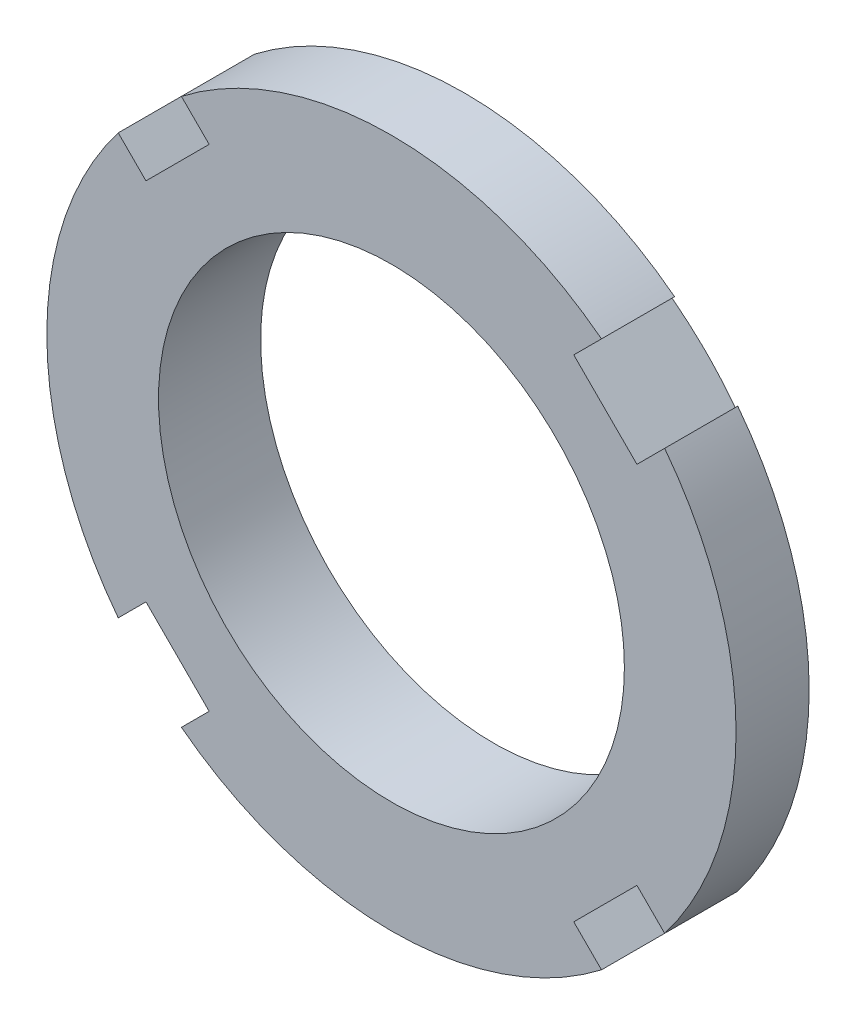
ISO-10303-21;
HEADER;
FILE_DESCRIPTION(('STEP AP214'),'2;1');
FILE_NAME('part.step','',(''),(''),'','','');
FILE_SCHEMA(('AUTOMOTIVE_DESIGN { 1 0 10303 214 1 1 1 1 }'));
ENDSEC;
DATA;
#1=APPLICATION_CONTEXT('core data for automotive mechanical design processes');
#2=APPLICATION_PROTOCOL_DEFINITION('international standard','automotive_design',2000,#1);
#3=PRODUCT_CONTEXT('',#1,'mechanical');
#4=PRODUCT('Part','Part','',(#3));
#5=PRODUCT_RELATED_PRODUCT_CATEGORY('part','',(#4));
#6=PRODUCT_DEFINITION_FORMATION('','',#4);
#7=PRODUCT_DEFINITION_CONTEXT('part definition',#1,'design');
#8=PRODUCT_DEFINITION('design','',#6,#7);
#9=PRODUCT_DEFINITION_SHAPE('','',#8);
#10=(LENGTH_UNIT() NAMED_UNIT(*) SI_UNIT(.MILLI.,.METRE.));
#11=(NAMED_UNIT(*) PLANE_ANGLE_UNIT() SI_UNIT($,.RADIAN.));
#12=(NAMED_UNIT(*) SI_UNIT($,.STERADIAN.) SOLID_ANGLE_UNIT());
#13=UNCERTAINTY_MEASURE_WITH_UNIT(LENGTH_MEASURE(1.E-05),#10,'distance_accuracy_value','');
#14=(GEOMETRIC_REPRESENTATION_CONTEXT(3) GLOBAL_UNCERTAINTY_ASSIGNED_CONTEXT((#13)) GLOBAL_UNIT_ASSIGNED_CONTEXT((#10,
#11,#12)) REPRESENTATION_CONTEXT('',''));
#15=CARTESIAN_POINT('',(0.,0.,0.));
#16=DIRECTION('',(0.,0.,1.));
#17=DIRECTION('',(1.,0.,0.));
#18=AXIS2_PLACEMENT_3D('',#15,#16,#17);
#19=CARTESIAN_POINT('',(0.,0.,8.));
#20=DIRECTION('',(0.,0.,-1.));
#21=DIRECTION('',(-1.,0.,0.));
#22=AXIS2_PLACEMENT_3D('',#19,#20,#21);
#23=CYLINDRICAL_SURFACE('',#22,27.);
#24=DIRECTION('',(0.,0.,1.));
#25=VECTOR('',#24,1.);
#26=CARTESIAN_POINT('',(-21.4056687517953,16.4559212834898,0.));
#27=LINE('',#26,#25);
#28=CARTESIAN_POINT('',(-21.4056687517953,16.4559212834898,2.27292657619126));
#29=VERTEX_POINT('',#28);
#30=CARTESIAN_POINT('',(-21.4056687517953,16.4559212834898,8.));
#31=VERTEX_POINT('',#30);
#32=EDGE_CURVE('E255',#29,#31,#27,.T.);
#33=ORIENTED_EDGE('',*,*,#32,.F.);
#34=CARTESIAN_POINT('',(0.,0.,2.27292657619126));
#35=DIRECTION('',(0.,0.,1.));
#36=DIRECTION('',(1.,0.,0.));
#37=AXIS2_PLACEMENT_3D('',#34,#35,#36);
#38=CIRCLE('',#37,27.);
#39=CARTESIAN_POINT('',(-21.4056687517956,-16.4559212834895,2.27292657619126));
#40=VERTEX_POINT('',#39);
#41=EDGE_CURVE('E250',#29,#40,#38,.T.);
#42=ORIENTED_EDGE('',*,*,#41,.T.);
#43=DIRECTION('',(0.,0.,1.));
#44=VECTOR('',#43,1.);
#45=CARTESIAN_POINT('',(-21.4056687517956,-16.4559212834895,0.));
#46=LINE('',#45,#44);
#47=CARTESIAN_POINT('',(-21.4056687517955,-16.4559212834895,8.));
#48=VERTEX_POINT('',#47);
#49=EDGE_CURVE('E275',#40,#48,#46,.T.);
#50=ORIENTED_EDGE('',*,*,#49,.T.);
#51=CARTESIAN_POINT('',(0.,0.,8.));
#52=DIRECTION('',(0.,0.,1.));
#53=DIRECTION('',(1.,0.,0.));
#54=AXIS2_PLACEMENT_3D('',#51,#52,#53);
#55=CIRCLE('',#54,27.);
#56=EDGE_CURVE('E192',#31,#48,#55,.T.);
#57=ORIENTED_EDGE('',*,*,#56,.F.);
#58=EDGE_LOOP('',(#33,#42,#50,#57));
#59=FACE_BOUND('',#58,.T.);
#60=ADVANCED_FACE('F33',(#59),#23,.T.);
#61=DIRECTION('',(0.,0.,1.));
#62=VECTOR('',#61,1.);
#63=CARTESIAN_POINT('',(-16.4559212834897,-21.4056687517954,0.));
#64=LINE('',#63,#62);
#65=CARTESIAN_POINT('',(-16.4559212834897,-21.4056687517954,2.27292657619126));
#66=VERTEX_POINT('',#65);
#67=CARTESIAN_POINT('',(-16.4559212834897,-21.4056687517954,8.));
#68=VERTEX_POINT('',#67);
#69=EDGE_CURVE('E273',#66,#68,#64,.T.);
#70=ORIENTED_EDGE('',*,*,#69,.F.);
#71=CARTESIAN_POINT('',(16.4559212834896,-21.4056687517955,2.27292657619126));
#72=VERTEX_POINT('',#71);
#73=EDGE_CURVE('E169',#66,#72,#38,.T.);
#74=ORIENTED_EDGE('',*,*,#73,.T.);
#75=DIRECTION('',(0.,0.,1.));
#76=VECTOR('',#75,1.);
#77=CARTESIAN_POINT('',(16.4559212834896,-21.4056687517955,0.));
#78=LINE('',#77,#76);
#79=CARTESIAN_POINT('',(16.4559212834896,-21.4056687517955,8.));
#80=VERTEX_POINT('',#79);
#81=EDGE_CURVE('E218',#72,#80,#78,.T.);
#82=ORIENTED_EDGE('',*,*,#81,.T.);
#83=EDGE_CURVE('E197',#68,#80,#55,.T.);
#84=ORIENTED_EDGE('',*,*,#83,.F.);
#85=EDGE_LOOP('',(#70,#74,#82,#84));
#86=FACE_BOUND('',#85,.T.);
#87=ADVANCED_FACE('F394',(#86),#23,.T.);
#88=DIRECTION('',(0.,0.,1.));
#89=VECTOR('',#88,1.);
#90=CARTESIAN_POINT('',(21.4056687517954,-16.4559212834897,0.));
#91=LINE('',#90,#89);
#92=CARTESIAN_POINT('',(21.4056687517954,-16.4559212834897,2.27292657619126));
#93=VERTEX_POINT('',#92);
#94=CARTESIAN_POINT('',(21.4056687517954,-16.4559212834897,8.));
#95=VERTEX_POINT('',#94);
#96=EDGE_CURVE('E168',#93,#95,#91,.T.);
#97=ORIENTED_EDGE('',*,*,#96,.F.);
#98=CARTESIAN_POINT('',(21.4056687517954,16.4559212834897,2.27292657619126));
#99=VERTEX_POINT('',#98);
#100=EDGE_CURVE('E153',#93,#99,#38,.T.);
#101=ORIENTED_EDGE('',*,*,#100,.T.);
#102=DIRECTION('',(0.,0.,1.));
#103=VECTOR('',#102,1.);
#104=CARTESIAN_POINT('',(21.4056687517954,16.4559212834897,0.));
#105=LINE('',#104,#103);
#106=CARTESIAN_POINT('',(21.4056687517954,16.4559212834897,8.));
#107=VERTEX_POINT('',#106);
#108=EDGE_CURVE('E166',#99,#107,#105,.T.);
#109=ORIENTED_EDGE('',*,*,#108,.T.);
#110=EDGE_CURVE('E188',#95,#107,#55,.T.);
#111=ORIENTED_EDGE('',*,*,#110,.F.);
#112=EDGE_LOOP('',(#97,#101,#109,#111));
#113=FACE_BOUND('',#112,.T.);
#114=ADVANCED_FACE('F164',(#113),#23,.T.);
#115=CARTESIAN_POINT('',(0.,0.,8.));
#116=DIRECTION('',(0.,0.,1.));
#117=DIRECTION('',(1.,0.,0.));
#118=AXIS2_PLACEMENT_3D('',#115,#116,#117);
#119=PLANE('',#118);
#120=DIRECTION('',(0.70710678118654,-0.707106781186555,0.));
#121=VECTOR('',#120,1.);
#122=CARTESIAN_POINT('',(-21.4056687517953,16.4559212834898,8.));
#123=LINE('',#122,#121);
#124=CARTESIAN_POINT('',(-19.233304448274,14.2835569799684,8.));
#125=VERTEX_POINT('',#124);
#126=EDGE_CURVE('E260',#31,#125,#123,.T.);
#127=ORIENTED_EDGE('',*,*,#126,.F.);
#128=ORIENTED_EDGE('',*,*,#56,.T.);
#129=DIRECTION('',(-0.70710678118655,-0.707106781186545,0.));
#130=VECTOR('',#129,1.);
#131=CARTESIAN_POINT('',(-21.4056687517955,-16.4559212834895,8.));
#132=LINE('',#131,#130);
#133=CARTESIAN_POINT('',(-19.2333044482742,-14.2835569799682,8.));
#134=VERTEX_POINT('',#133);
#135=EDGE_CURVE('E267',#134,#48,#132,.T.);
#136=ORIENTED_EDGE('',*,*,#135,.F.);
#137=DIRECTION('',(-0.707106781186544,0.707106781186551,0.));
#138=VECTOR('',#137,1.);
#139=CARTESIAN_POINT('',(-14.2835569799684,-19.233304448274,8.));
#140=LINE('',#139,#138);
#141=CARTESIAN_POINT('',(-14.2835569799684,-19.233304448274,8.));
#142=VERTEX_POINT('',#141);
#143=EDGE_CURVE('E264',#142,#134,#140,.T.);
#144=ORIENTED_EDGE('',*,*,#143,.F.);
#145=DIRECTION('',(0.707106781186552,0.707106781186543,0.));
#146=VECTOR('',#145,1.);
#147=CARTESIAN_POINT('',(-16.4559212834897,-21.4056687517954,8.));
#148=LINE('',#147,#146);
#149=EDGE_CURVE('E211',#68,#142,#148,.T.);
#150=ORIENTED_EDGE('',*,*,#149,.F.);
#151=ORIENTED_EDGE('',*,*,#83,.T.);
#152=DIRECTION('',(0.707106781186548,-0.707106781186547,0.));
#153=VECTOR('',#152,1.);
#154=CARTESIAN_POINT('',(16.4559212834896,-21.4056687517955,8.));
#155=LINE('',#154,#153);
#156=CARTESIAN_POINT('',(14.2835569799682,-19.2333044482741,8.));
#157=VERTEX_POINT('',#156);
#158=EDGE_CURVE('E208',#157,#80,#155,.T.);
#159=ORIENTED_EDGE('',*,*,#158,.F.);
#160=DIRECTION('',(-0.707106781186548,-0.707106781186547,0.));
#161=VECTOR('',#160,1.);
#162=CARTESIAN_POINT('',(19.2333044482741,-14.2835569799683,8.));
#163=LINE('',#162,#161);
#164=CARTESIAN_POINT('',(19.2333044482741,-14.2835569799683,8.));
#165=VERTEX_POINT('',#164);
#166=EDGE_CURVE('E223',#165,#157,#163,.T.);
#167=ORIENTED_EDGE('',*,*,#166,.F.);
#168=DIRECTION('',(-0.707106781186545,0.70710678118655,0.));
#169=VECTOR('',#168,1.);
#170=CARTESIAN_POINT('',(21.4056687517954,-16.4559212834897,8.));
#171=LINE('',#170,#169);
#172=EDGE_CURVE('E222',#95,#165,#171,.T.);
#173=ORIENTED_EDGE('',*,*,#172,.F.);
#174=ORIENTED_EDGE('',*,*,#110,.T.);
#175=DIRECTION('',(0.707106781186545,0.70710678118655,0.));
#176=VECTOR('',#175,1.);
#177=CARTESIAN_POINT('',(21.4056687517954,16.4559212834897,8.));
#178=LINE('',#177,#176);
#179=CARTESIAN_POINT('',(19.2333044482741,14.2835569799683,8.));
#180=VERTEX_POINT('',#179);
#181=EDGE_CURVE('E175',#180,#107,#178,.T.);
#182=ORIENTED_EDGE('',*,*,#181,.F.);
#183=DIRECTION('',(0.707106781186549,-0.707106781186546,0.));
#184=VECTOR('',#183,1.);
#185=CARTESIAN_POINT('',(14.2835569799682,19.2333044482741,8.));
#186=LINE('',#185,#184);
#187=CARTESIAN_POINT('',(14.2835569799682,19.2333044482741,8.));
#188=VERTEX_POINT('',#187);
#189=EDGE_CURVE('E233',#188,#180,#186,.T.);
#190=ORIENTED_EDGE('',*,*,#189,.F.);
#191=DIRECTION('',(-0.707106781186547,-0.707106781186548,0.));
#192=VECTOR('',#191,1.);
#193=CARTESIAN_POINT('',(16.4559212834896,21.4056687517955,8.));
#194=LINE('',#193,#192);
#195=CARTESIAN_POINT('',(16.4559212834896,21.4056687517955,8.));
#196=VERTEX_POINT('',#195);
#197=EDGE_CURVE('E181',#196,#188,#194,.T.);
#198=ORIENTED_EDGE('',*,*,#197,.F.);
#199=CARTESIAN_POINT('',(-16.4559212834894,21.4056687517956,8.));
#200=VERTEX_POINT('',#199);
#201=EDGE_CURVE('E46',#196,#200,#55,.T.);
#202=ORIENTED_EDGE('',*,*,#201,.T.);
#203=DIRECTION('',(-0.707106781186543,0.707106781186552,0.));
#204=VECTOR('',#203,1.);
#205=CARTESIAN_POINT('',(-16.4559212834894,21.4056687517956,8.));
#206=LINE('',#205,#204);
#207=CARTESIAN_POINT('',(-14.2835569799681,19.2333044482742,8.));
#208=VERTEX_POINT('',#207);
#209=EDGE_CURVE('E254',#208,#200,#206,.T.);
#210=ORIENTED_EDGE('',*,*,#209,.F.);
#211=DIRECTION('',(0.707106781186553,0.707106781186542,0.));
#212=VECTOR('',#211,1.);
#213=CARTESIAN_POINT('',(-19.233304448274,14.2835569799684,8.));
#214=LINE('',#213,#212);
#215=EDGE_CURVE('E408',#125,#208,#214,.T.);
#216=ORIENTED_EDGE('',*,*,#215,.F.);
#217=EDGE_LOOP('',(#127,#128,#136,#144,#150,#151,#159,#167,#173,#174,#182,#190,#198,#202,#210,#216));
#218=FACE_BOUND('',#217,.T.);
#219=CARTESIAN_POINT('',(0.,0.,8.));
#220=DIRECTION('',(0.,0.,1.));
#221=DIRECTION('',(1.,0.,0.));
#222=AXIS2_PLACEMENT_3D('',#219,#220,#221);
#223=CIRCLE('',#222,18.25);
#224=CARTESIAN_POINT('',(18.25,0.,8.));
#225=VERTEX_POINT('',#224);
#226=EDGE_CURVE('E185',#225,#225,#223,.T.);
#227=ORIENTED_EDGE('',*,*,#226,.F.);
#228=EDGE_LOOP('',(#227));
#229=FACE_BOUND('',#228,.T.);
#230=ADVANCED_FACE('F205',(#218,#229),#119,.T.);
#231=CARTESIAN_POINT('',(0.,0.,0.));
#232=DIRECTION('',(0.,0.,1.));
#233=DIRECTION('',(1.,0.,0.));
#234=AXIS2_PLACEMENT_3D('',#231,#232,#233);
#235=PLANE('',#234);
#236=CARTESIAN_POINT('',(0.,0.,0.));
#237=DIRECTION('',(0.,0.,1.));
#238=DIRECTION('',(1.,0.,0.));
#239=AXIS2_PLACEMENT_3D('',#236,#237,#238);
#240=CIRCLE('',#239,23.5);
#241=CARTESIAN_POINT('',(23.5,0.,0.));
#242=VERTEX_POINT('',#241);
#243=EDGE_CURVE('E249',#242,#242,#240,.T.);
#244=ORIENTED_EDGE('',*,*,#243,.F.);
#245=EDGE_LOOP('',(#244));
#246=FACE_BOUND('',#245,.T.);
#247=CARTESIAN_POINT('',(0.,0.,0.));
#248=DIRECTION('',(0.,0.,1.));
#249=DIRECTION('',(1.,0.,0.));
#250=AXIS2_PLACEMENT_3D('',#247,#248,#249);
#251=CIRCLE('',#250,18.25);
#252=CARTESIAN_POINT('',(18.25,0.,0.));
#253=VERTEX_POINT('',#252);
#254=EDGE_CURVE('E189',#253,#253,#251,.T.);
#255=ORIENTED_EDGE('',*,*,#254,.T.);
#256=EDGE_LOOP('',(#255));
#257=FACE_BOUND('',#256,.T.);
#258=ADVANCED_FACE('F385',(#246,#257),#235,.F.);
#259=DIRECTION('',(0.,0.,1.));
#260=VECTOR('',#259,1.);
#261=CARTESIAN_POINT('',(16.4559212834896,21.4056687517955,0.));
#262=LINE('',#261,#260);
#263=CARTESIAN_POINT('',(16.4559212834896,21.4056687517955,2.27292657619126));
#264=VERTEX_POINT('',#263);
#265=EDGE_CURVE('E176',#264,#196,#262,.T.);
#266=ORIENTED_EDGE('',*,*,#265,.F.);
#267=CARTESIAN_POINT('',(-16.4559212834894,21.4056687517956,2.27292657619126));
#268=VERTEX_POINT('',#267);
#269=EDGE_CURVE('E171',#264,#268,#38,.T.);
#270=ORIENTED_EDGE('',*,*,#269,.T.);
#271=DIRECTION('',(0.,0.,1.));
#272=VECTOR('',#271,1.);
#273=CARTESIAN_POINT('',(-16.4559212834894,21.4056687517956,0.));
#274=LINE('',#273,#272);
#275=EDGE_CURVE('E60',#268,#200,#274,.T.);
#276=ORIENTED_EDGE('',*,*,#275,.T.);
#277=ORIENTED_EDGE('',*,*,#201,.F.);
#278=EDGE_LOOP('',(#266,#270,#276,#277));
#279=FACE_BOUND('',#278,.T.);
#280=ADVANCED_FACE('F35',(#279),#23,.T.);
#281=CARTESIAN_POINT('',(0.,0.,8.));
#282=DIRECTION('',(0.,0.,-1.));
#283=DIRECTION('',(-1.,0.,0.));
#284=AXIS2_PLACEMENT_3D('',#281,#282,#283);
#285=CYLINDRICAL_SURFACE('',#284,18.25);
#286=ORIENTED_EDGE('',*,*,#226,.T.);
#287=EDGE_LOOP('',(#286));
#288=FACE_BOUND('',#287,.T.);
#289=ORIENTED_EDGE('',*,*,#254,.F.);
#290=EDGE_LOOP('',(#289));
#291=FACE_BOUND('',#290,.T.);
#292=ADVANCED_FACE('F379',(#288,#291),#285,.F.);
#293=CARTESIAN_POINT('',(14.2835569799682,19.2333044482741,0.));
#294=DIRECTION('',(-0.707106781186546,-0.707106781186549,0.));
#295=DIRECTION('',(0.707106781186549,-0.707106781186546,0.));
#296=AXIS2_PLACEMENT_3D('',#293,#294,#295);
#297=PLANE('',#296);
#298=DIRECTION('',(0.,0.,1.));
#299=VECTOR('',#298,1.);
#300=CARTESIAN_POINT('',(19.2333044482741,14.2835569799683,0.));
#301=LINE('',#300,#299);
#302=CARTESIAN_POINT('',(19.2333044482741,14.2835569799683,0.296808423875628));
#303=VERTEX_POINT('',#302);
#304=EDGE_CURVE('E177',#303,#180,#301,.T.);
#305=ORIENTED_EDGE('',*,*,#304,.F.);
#306=CARTESIAN_POINT('',(19.2335044482741,14.2833569799683,0.296835259662044));
#307=CARTESIAN_POINT('',(19.0276255765084,14.4892358517339,0.269204998764408));
#308=CARTESIAN_POINT('',(18.8215271464313,14.6953342818111,0.244928484965329));
#309=CARTESIAN_POINT('',(18.4089816121952,15.1078798160472,0.203205328642449));
#310=CARTESIAN_POINT('',(18.2025345020211,15.3143269262213,0.185758805179095));
#311=CARTESIAN_POINT('',(17.5837846466935,15.9330767815489,0.143914531250112));
#312=CARTESIAN_POINT('',(17.1711076804073,16.345753747835,0.129881518639503));
#313=CARTESIAN_POINT('',(16.345753747835,17.1711076804074,0.129881518639504));
#314=CARTESIAN_POINT('',(15.9330767815488,17.5837846466936,0.143914531250114));
#315=CARTESIAN_POINT('',(15.3143269262212,18.2025345020212,0.185758805179094));
#316=CARTESIAN_POINT('',(15.1078798160471,18.4089816121952,0.203205328642446));
#317=CARTESIAN_POINT('',(14.695334281811,18.8215271464313,0.244928484965325));
#318=CARTESIAN_POINT('',(14.4892358517339,19.0276255765085,0.269204998764403));
#319=CARTESIAN_POINT('',(14.2833569799682,19.2335044482741,0.296835259662042));
#320=B_SPLINE_CURVE_WITH_KNOTS('',3,(#306,#307,#308,#309,#310,#311,#312,#313,#314,#315,#316,
#317,#318,#319),.UNSPECIFIED.,.F.,.F.,(4,2,2,2,2,2,4),(0.,0.877357997829844,1.75473128909054,
3.50536630015111,5.25600131121167,6.13337460247237,7.01073260030221),.UNSPECIFIED.);
#321=CARTESIAN_POINT('',(14.2835569799682,19.2333044482741,0.296808423875627));
#322=VERTEX_POINT('',#321);
#323=EDGE_CURVE('E156',#303,#322,#320,.T.);
#324=ORIENTED_EDGE('',*,*,#323,.T.);
#325=DIRECTION('',(0.,0.,1.));
#326=VECTOR('',#325,1.);
#327=CARTESIAN_POINT('',(14.2835569799682,19.2333044482741,0.));
#328=LINE('',#327,#326);
#329=EDGE_CURVE('E179',#322,#188,#328,.T.);
#330=ORIENTED_EDGE('',*,*,#329,.T.);
#331=ORIENTED_EDGE('',*,*,#189,.T.);
#332=EDGE_LOOP('',(#305,#324,#330,#331));
#333=FACE_BOUND('',#332,.T.);
#334=ADVANCED_FACE('F243',(#333),#297,.F.);
#335=CARTESIAN_POINT('',(16.4559212834896,21.4056687517955,0.));
#336=DIRECTION('',(-0.707106781186548,0.707106781186547,0.));
#337=DIRECTION('',(-0.707106781186547,-0.707106781186548,0.));
#338=AXIS2_PLACEMENT_3D('',#335,#336,#337);
#339=PLANE('',#338);
#340=ORIENTED_EDGE('',*,*,#329,.F.);
#341=CARTESIAN_POINT('',(14.2833569799682,19.2331044482741,0.296626714473345));
#342=CARTESIAN_POINT('',(14.6456065649505,19.5953540332564,0.625771711017591));
#343=CARTESIAN_POINT('',(15.0077950501456,19.9575425184515,0.955051042645041));
#344=CARTESIAN_POINT('',(15.732049817985,20.6817972862909,1.61387837335876));
#345=CARTESIAN_POINT('',(16.0941161006304,21.0438635689363,1.94342637244281));
#346=CARTESIAN_POINT('',(16.4561212834896,21.4058687517955,2.27310870660786));
#347=B_SPLINE_CURVE_WITH_KNOTS('',3,(#341,#342,#343,#344,#345,#346),.UNSPECIFIED.,.F.,.F.,(4,2,
4),(0.,1.82676568904602,3.65353136307705),.UNSPECIFIED.);
#348=EDGE_CURVE('E370',#322,#264,#347,.T.);
#349=ORIENTED_EDGE('',*,*,#348,.T.);
#350=ORIENTED_EDGE('',*,*,#265,.T.);
#351=ORIENTED_EDGE('',*,*,#197,.T.);
#352=EDGE_LOOP('',(#340,#349,#350,#351));
#353=FACE_BOUND('',#352,.T.);
#354=ADVANCED_FACE('F247',(#353),#339,.F.);
#355=CARTESIAN_POINT('',(21.4056687517954,16.4559212834897,0.));
#356=DIRECTION('',(0.70710678118655,-0.707106781186545,0.));
#357=DIRECTION('',(0.707106781186545,0.70710678118655,0.));
#358=AXIS2_PLACEMENT_3D('',#355,#356,#357);
#359=PLANE('',#358);
#360=ORIENTED_EDGE('',*,*,#108,.F.);
#361=CARTESIAN_POINT('',(21.4058687517954,16.4561212834897,2.27310870660787));
#362=CARTESIAN_POINT('',(21.0438635689362,16.0941161006304,1.94342637244281));
#363=CARTESIAN_POINT('',(20.6817972862909,15.7320498179851,1.61387837335876));
#364=CARTESIAN_POINT('',(19.9575425184514,15.0077950501456,0.955051042645044));
#365=CARTESIAN_POINT('',(19.5953540332563,14.6456065649505,0.625771711017594));
#366=CARTESIAN_POINT('',(19.2331044482741,14.2833569799683,0.29662671447335));
#367=B_SPLINE_CURVE_WITH_KNOTS('',3,(#361,#362,#363,#364,#365,#366),.UNSPECIFIED.,.F.,.F.,(4,2,
4),(0.,1.82676567403102,3.65353136307704),.UNSPECIFIED.);
#368=EDGE_CURVE('E150',#99,#303,#367,.T.);
#369=ORIENTED_EDGE('',*,*,#368,.T.);
#370=ORIENTED_EDGE('',*,*,#304,.T.);
#371=ORIENTED_EDGE('',*,*,#181,.T.);
#372=EDGE_LOOP('',(#360,#369,#370,#371));
#373=FACE_BOUND('',#372,.T.);
#374=ADVANCED_FACE('F173',(#373),#359,.F.);
#375=CARTESIAN_POINT('',(19.2333044482741,-14.2835569799683,0.));
#376=DIRECTION('',(-0.707106781186547,0.707106781186548,0.));
#377=DIRECTION('',(-0.707106781186548,-0.707106781186547,0.));
#378=AXIS2_PLACEMENT_3D('',#375,#376,#377);
#379=PLANE('',#378);
#380=DIRECTION('',(0.,0.,1.));
#381=VECTOR('',#380,1.);
#382=CARTESIAN_POINT('',(14.2835569799682,-19.2333044482741,0.));
#383=LINE('',#382,#381);
#384=CARTESIAN_POINT('',(14.2835569799682,-19.2333044482741,0.296808423875627));
#385=VERTEX_POINT('',#384);
#386=EDGE_CURVE('E220',#385,#157,#383,.T.);
#387=ORIENTED_EDGE('',*,*,#386,.F.);
#388=CARTESIAN_POINT('',(14.2833569799682,-19.2335044482741,0.296835259662046));
#389=CARTESIAN_POINT('',(14.4892358517339,-19.0276255765085,0.26920499876441));
#390=CARTESIAN_POINT('',(14.695334281811,-18.8215271464313,0.244928484965331));
#391=CARTESIAN_POINT('',(15.1078798160471,-18.4089816121953,0.20320532864245));
#392=CARTESIAN_POINT('',(15.3143269262212,-18.2025345020212,0.185758805179095));
#393=CARTESIAN_POINT('',(15.9330767815488,-17.5837846466936,0.143914531250111));
#394=CARTESIAN_POINT('',(16.345753747835,-17.1711076804074,0.129881518639502));
#395=CARTESIAN_POINT('',(17.1711076804073,-16.345753747835,0.129881518639503));
#396=CARTESIAN_POINT('',(17.5837846466935,-15.9330767815489,0.143914531250112));
#397=CARTESIAN_POINT('',(18.2025345020211,-15.3143269262213,0.185758805179094));
#398=CARTESIAN_POINT('',(18.4089816121952,-15.1078798160472,0.203205328642448));
#399=CARTESIAN_POINT('',(18.8215271464313,-14.6953342818111,0.244928484965328));
#400=CARTESIAN_POINT('',(19.0276255765084,-14.4892358517339,0.269204998764406));
#401=CARTESIAN_POINT('',(19.2335044482741,-14.2833569799683,0.296835259662043));
#402=B_SPLINE_CURVE_WITH_KNOTS('',3,(#388,#389,#390,#391,#392,#393,#394,#395,#396,#397,#398,
#399,#400,#401),.UNSPECIFIED.,.F.,.F.,(4,2,2,2,2,2,4),(0.,0.877357997829843,1.75473128909054,
3.50536630015111,5.25600131121167,6.13337460247237,7.01073260030222),.UNSPECIFIED.);
#403=CARTESIAN_POINT('',(19.2333044482741,-14.2835569799683,0.296808423875628));
#404=VERTEX_POINT('',#403);
#405=EDGE_CURVE('E350',#385,#404,#402,.T.);
#406=ORIENTED_EDGE('',*,*,#405,.T.);
#407=DIRECTION('',(0.,0.,1.));
#408=VECTOR('',#407,1.);
#409=CARTESIAN_POINT('',(19.2333044482741,-14.2835569799683,0.));
#410=LINE('',#409,#408);
#411=EDGE_CURVE('E231',#404,#165,#410,.T.);
#412=ORIENTED_EDGE('',*,*,#411,.T.);
#413=ORIENTED_EDGE('',*,*,#166,.T.);
#414=EDGE_LOOP('',(#387,#406,#412,#413));
#415=FACE_BOUND('',#414,.T.);
#416=ADVANCED_FACE('F426',(#415),#379,.F.);
#417=CARTESIAN_POINT('',(21.4056687517954,-16.4559212834897,0.));
#418=DIRECTION('',(0.70710678118655,0.707106781186545,0.));
#419=DIRECTION('',(-0.707106781186545,0.70710678118655,0.));
#420=AXIS2_PLACEMENT_3D('',#417,#418,#419);
#421=PLANE('',#420);
#422=ORIENTED_EDGE('',*,*,#411,.F.);
#423=CARTESIAN_POINT('',(19.2331044482741,-14.2833569799683,0.29662671447335));
#424=CARTESIAN_POINT('',(19.5953540332563,-14.6456065649505,0.625771711017594));
#425=CARTESIAN_POINT('',(19.9575425184514,-15.0077950501456,0.955051042645043));
#426=CARTESIAN_POINT('',(20.6817972862909,-15.7320498179851,1.61387837335876));
#427=CARTESIAN_POINT('',(21.0438635689362,-16.0941161006304,1.94342637244281));
#428=CARTESIAN_POINT('',(21.4058687517954,-16.4561212834897,2.27310870660786));
#429=B_SPLINE_CURVE_WITH_KNOTS('',3,(#423,#424,#425,#426,#427,#428),.UNSPECIFIED.,.F.,.F.,(4,2,
4),(0.,1.82676568904602,3.65353136307704),.UNSPECIFIED.);
#430=EDGE_CURVE('E160',#404,#93,#429,.T.);
#431=ORIENTED_EDGE('',*,*,#430,.T.);
#432=ORIENTED_EDGE('',*,*,#96,.T.);
#433=ORIENTED_EDGE('',*,*,#172,.T.);
#434=EDGE_LOOP('',(#422,#431,#432,#433));
#435=FACE_BOUND('',#434,.T.);
#436=ADVANCED_FACE('F423',(#435),#421,.F.);
#437=CARTESIAN_POINT('',(16.4559212834896,-21.4056687517955,0.));
#438=DIRECTION('',(-0.707106781186547,-0.707106781186548,0.));
#439=DIRECTION('',(0.707106781186548,-0.707106781186547,0.));
#440=AXIS2_PLACEMENT_3D('',#437,#438,#439);
#441=PLANE('',#440);
#442=ORIENTED_EDGE('',*,*,#81,.F.);
#443=CARTESIAN_POINT('',(16.4561212834896,-21.4058687517955,2.27310870660786));
#444=CARTESIAN_POINT('',(16.0941161006304,-21.0438635689363,1.94342637244281));
#445=CARTESIAN_POINT('',(15.732049817985,-20.6817972862909,1.61387837335876));
#446=CARTESIAN_POINT('',(15.0077950501456,-19.9575425184515,0.955051042645042));
#447=CARTESIAN_POINT('',(14.6456065649505,-19.5953540332564,0.625771711017593));
#448=CARTESIAN_POINT('',(14.2833569799682,-19.2331044482741,0.296626714473348));
#449=B_SPLINE_CURVE_WITH_KNOTS('',3,(#443,#444,#445,#446,#447,#448),.UNSPECIFIED.,.F.,.F.,(4,2,
4),(0.,1.82676567403102,3.65353136307704),.UNSPECIFIED.);
#450=EDGE_CURVE('E343',#72,#385,#449,.T.);
#451=ORIENTED_EDGE('',*,*,#450,.T.);
#452=ORIENTED_EDGE('',*,*,#386,.T.);
#453=ORIENTED_EDGE('',*,*,#158,.T.);
#454=EDGE_LOOP('',(#442,#451,#452,#453));
#455=FACE_BOUND('',#454,.T.);
#456=ADVANCED_FACE('F216',(#455),#441,.F.);
#457=CARTESIAN_POINT('',(-14.2835569799684,-19.233304448274,0.));
#458=DIRECTION('',(0.707106781186551,0.707106781186544,0.));
#459=DIRECTION('',(-0.707106781186544,0.707106781186551,0.));
#460=AXIS2_PLACEMENT_3D('',#457,#458,#459);
#461=PLANE('',#460);
#462=DIRECTION('',(0.,0.,1.));
#463=VECTOR('',#462,1.);
#464=CARTESIAN_POINT('',(-19.2333044482742,-14.2835569799682,0.));
#465=LINE('',#464,#463);
#466=CARTESIAN_POINT('',(-19.2333044482742,-14.2835569799682,0.296808423875628));
#467=VERTEX_POINT('',#466);
#468=EDGE_CURVE('E271',#467,#134,#465,.T.);
#469=ORIENTED_EDGE('',*,*,#468,.F.);
#470=CARTESIAN_POINT('',(-19.2335044482742,-14.2833569799682,0.296835259662043));
#471=CARTESIAN_POINT('',(-19.0276255765085,-14.4892358517338,0.269204998764407));
#472=CARTESIAN_POINT('',(-18.8215271464314,-14.695334281811,0.244928484965328));
#473=CARTESIAN_POINT('',(-18.4089816121953,-15.107879816047,0.203205328642448));
#474=CARTESIAN_POINT('',(-18.2025345020212,-15.3143269262211,0.185758805179094));
#475=CARTESIAN_POINT('',(-17.5837846466936,-15.9330767815487,0.143914531250111));
#476=CARTESIAN_POINT('',(-17.1711076804074,-16.3457537478349,0.129881518639501));
#477=CARTESIAN_POINT('',(-16.3457537478351,-17.1711076804073,0.129881518639502));
#478=CARTESIAN_POINT('',(-15.9330767815489,-17.5837846466934,0.143914531250114));
#479=CARTESIAN_POINT('',(-15.3143269262213,-18.202534502021,0.185758805179094));
#480=CARTESIAN_POINT('',(-15.1078798160472,-18.4089816121951,0.203205328642446));
#481=CARTESIAN_POINT('',(-14.6953342818112,-18.8215271464312,0.244928484965325));
#482=CARTESIAN_POINT('',(-14.489235851734,-19.0276255765084,0.269204998764403));
#483=CARTESIAN_POINT('',(-14.2833569799684,-19.233504448274,0.296835259662043));
#484=B_SPLINE_CURVE_WITH_KNOTS('',3,(#470,#471,#472,#473,#474,#475,#476,#477,#478,#479,#480,
#481,#482,#483),.UNSPECIFIED.,.F.,.F.,(4,2,2,2,2,2,4),(0.,0.877357997829846,1.75473128909055,
3.50536630015111,5.25600131121167,6.13337460247238,7.01073260030222),.UNSPECIFIED.);
#485=CARTESIAN_POINT('',(-14.2835569799684,-19.233304448274,0.296808423875626));
#486=VERTEX_POINT('',#485);
#487=EDGE_CURVE('E330',#467,#486,#484,.T.);
#488=ORIENTED_EDGE('',*,*,#487,.T.);
#489=DIRECTION('',(0.,0.,1.));
#490=VECTOR('',#489,1.);
#491=CARTESIAN_POINT('',(-14.2835569799684,-19.233304448274,0.));
#492=LINE('',#491,#490);
#493=EDGE_CURVE('E227',#486,#142,#492,.T.);
#494=ORIENTED_EDGE('',*,*,#493,.T.);
#495=ORIENTED_EDGE('',*,*,#143,.T.);
#496=EDGE_LOOP('',(#469,#488,#494,#495));
#497=FACE_BOUND('',#496,.T.);
#498=ADVANCED_FACE('F285',(#497),#461,.F.);
#499=CARTESIAN_POINT('',(-16.4559212834897,-21.4056687517954,0.));
#500=DIRECTION('',(0.707106781186543,-0.707106781186552,0.));
#501=DIRECTION('',(0.707106781186552,0.707106781186543,0.));
#502=AXIS2_PLACEMENT_3D('',#499,#500,#501);
#503=PLANE('',#502);
#504=ORIENTED_EDGE('',*,*,#493,.F.);
#505=CARTESIAN_POINT('',(-14.2833569799684,-19.233104448274,0.296626714473345));
#506=CARTESIAN_POINT('',(-14.6456065649506,-19.5953540332563,0.625771711017591));
#507=CARTESIAN_POINT('',(-15.0077950501457,-19.9575425184514,0.955051042645041));
#508=CARTESIAN_POINT('',(-15.7320498179852,-20.6817972862908,1.61387837335876));
#509=CARTESIAN_POINT('',(-16.0941161006305,-21.0438635689362,1.94342637244281));
#510=CARTESIAN_POINT('',(-16.4561212834897,-21.4058687517954,2.27310870660787));
#511=B_SPLINE_CURVE_WITH_KNOTS('',3,(#505,#506,#507,#508,#509,#510),.UNSPECIFIED.,.F.,.F.,(4,2,
4),(0.,1.82676568904602,3.65353136307705),.UNSPECIFIED.);
#512=EDGE_CURVE('E337',#486,#66,#511,.T.);
#513=ORIENTED_EDGE('',*,*,#512,.T.);
#514=ORIENTED_EDGE('',*,*,#69,.T.);
#515=ORIENTED_EDGE('',*,*,#149,.T.);
#516=EDGE_LOOP('',(#504,#513,#514,#515));
#517=FACE_BOUND('',#516,.T.);
#518=ADVANCED_FACE('F403',(#517),#503,.F.);
#519=CARTESIAN_POINT('',(-21.4056687517955,-16.4559212834895,0.));
#520=DIRECTION('',(-0.707106781186545,0.70710678118655,0.));
#521=DIRECTION('',(-0.70710678118655,-0.707106781186545,0.));
#522=AXIS2_PLACEMENT_3D('',#519,#520,#521);
#523=PLANE('',#522);
#524=ORIENTED_EDGE('',*,*,#49,.F.);
#525=CARTESIAN_POINT('',(-21.4058687517956,-16.4561212834895,2.27310870660787));
#526=CARTESIAN_POINT('',(-21.0438635689363,-16.0941161006303,1.94342637244281));
#527=CARTESIAN_POINT('',(-20.681797286291,-15.7320498179849,1.61387837335876));
#528=CARTESIAN_POINT('',(-19.9575425184515,-15.0077950501455,0.955051042645043));
#529=CARTESIAN_POINT('',(-19.5953540332564,-14.6456065649504,0.625771711017593));
#530=CARTESIAN_POINT('',(-19.2331044482742,-14.2833569799682,0.296626714473349));
#531=B_SPLINE_CURVE_WITH_KNOTS('',3,(#525,#526,#527,#528,#529,#530),.UNSPECIFIED.,.F.,.F.,(4,2,
4),(0.,1.82676567403103,3.65353136307705),.UNSPECIFIED.);
#532=EDGE_CURVE('E282',#40,#467,#531,.T.);
#533=ORIENTED_EDGE('',*,*,#532,.T.);
#534=ORIENTED_EDGE('',*,*,#468,.T.);
#535=ORIENTED_EDGE('',*,*,#135,.T.);
#536=EDGE_LOOP('',(#524,#533,#534,#535));
#537=FACE_BOUND('',#536,.T.);
#538=ADVANCED_FACE('F280',(#537),#523,.F.);
#539=CARTESIAN_POINT('',(-19.233304448274,14.2835569799684,0.));
#540=DIRECTION('',(0.707106781186542,-0.707106781186553,0.));
#541=DIRECTION('',(0.707106781186553,0.707106781186542,0.));
#542=AXIS2_PLACEMENT_3D('',#539,#540,#541);
#543=PLANE('',#542);
#544=DIRECTION('',(0.,0.,1.));
#545=VECTOR('',#544,1.);
#546=CARTESIAN_POINT('',(-14.2835569799681,19.2333044482742,0.));
#547=LINE('',#546,#545);
#548=CARTESIAN_POINT('',(-14.2835569799681,19.2333044482742,0.296808423875628));
#549=VERTEX_POINT('',#548);
#550=EDGE_CURVE('E256',#549,#208,#547,.T.);
#551=ORIENTED_EDGE('',*,*,#550,.F.);
#552=CARTESIAN_POINT('',(-14.2833569799681,19.2335044482742,0.296835259662044));
#553=CARTESIAN_POINT('',(-14.4892358517337,19.0276255765086,0.269204998764407));
#554=CARTESIAN_POINT('',(-14.6953342818109,18.8215271464314,0.244928484965328));
#555=CARTESIAN_POINT('',(-15.107879816047,18.4089816121953,0.203205328642448));
#556=CARTESIAN_POINT('',(-15.3143269262211,18.2025345020213,0.185758805179094));
#557=CARTESIAN_POINT('',(-15.9330767815487,17.5837846466937,0.143914531250112));
#558=CARTESIAN_POINT('',(-16.3457537478349,17.1711076804075,0.129881518639501));
#559=CARTESIAN_POINT('',(-17.1711076804072,16.3457537478352,0.129881518639502));
#560=CARTESIAN_POINT('',(-17.5837846466934,15.933076781549,0.143914531250113));
#561=CARTESIAN_POINT('',(-18.202534502021,15.3143269262214,0.185758805179095));
#562=CARTESIAN_POINT('',(-18.4089816121951,15.1078798160473,0.203205328642448));
#563=CARTESIAN_POINT('',(-18.8215271464312,14.6953342818112,0.244928484965327));
#564=CARTESIAN_POINT('',(-19.0276255765083,14.4892358517341,0.269204998764405));
#565=CARTESIAN_POINT('',(-19.233504448274,14.2833569799684,0.296835259662043));
#566=B_SPLINE_CURVE_WITH_KNOTS('',3,(#552,#553,#554,#555,#556,#557,#558,#559,#560,#561,#562,
#563,#564,#565),.UNSPECIFIED.,.F.,.F.,(4,2,2,2,2,2,4),(0.,0.877357997829845,1.75473128909054,
3.50536630015111,5.25600131121167,6.13337460247237,7.01073260030221),.UNSPECIFIED.);
#567=CARTESIAN_POINT('',(-19.233304448274,14.2835569799684,0.296808423875626));
#568=VERTEX_POINT('',#567);
#569=EDGE_CURVE('E53',#549,#568,#566,.T.);
#570=ORIENTED_EDGE('',*,*,#569,.T.);
#571=DIRECTION('',(0.,0.,1.));
#572=VECTOR('',#571,1.);
#573=CARTESIAN_POINT('',(-19.233304448274,14.2835569799684,0.));
#574=LINE('',#573,#572);
#575=EDGE_CURVE('E258',#568,#125,#574,.T.);
#576=ORIENTED_EDGE('',*,*,#575,.T.);
#577=ORIENTED_EDGE('',*,*,#215,.T.);
#578=EDGE_LOOP('',(#551,#570,#576,#577));
#579=FACE_BOUND('',#578,.T.);
#580=ADVANCED_FACE('F309',(#579),#543,.F.);
#581=CARTESIAN_POINT('',(-21.4056687517953,16.4559212834898,0.));
#582=DIRECTION('',(-0.707106781186555,-0.70710678118654,0.));
#583=DIRECTION('',(0.70710678118654,-0.707106781186555,0.));
#584=AXIS2_PLACEMENT_3D('',#581,#582,#583);
#585=PLANE('',#584);
#586=ORIENTED_EDGE('',*,*,#575,.F.);
#587=CARTESIAN_POINT('',(-19.233104448274,14.2833569799684,0.29662671447335));
#588=CARTESIAN_POINT('',(-19.5953540332562,14.6456065649507,0.625771711017594));
#589=CARTESIAN_POINT('',(-19.9575425184513,15.0077950501458,0.955051042645043));
#590=CARTESIAN_POINT('',(-20.6817972862907,15.7320498179852,1.61387837335876));
#591=CARTESIAN_POINT('',(-21.0438635689361,16.0941161006306,1.94342637244281));
#592=CARTESIAN_POINT('',(-21.4058687517953,16.4561212834898,2.27310870660787));
#593=B_SPLINE_CURVE_WITH_KNOTS('',3,(#587,#588,#589,#590,#591,#592),.UNSPECIFIED.,.F.,.F.,(4,2,
4),(0.,1.82676568904602,3.65353136307704),.UNSPECIFIED.);
#594=EDGE_CURVE('E303',#568,#29,#593,.T.);
#595=ORIENTED_EDGE('',*,*,#594,.T.);
#596=ORIENTED_EDGE('',*,*,#32,.T.);
#597=ORIENTED_EDGE('',*,*,#126,.T.);
#598=EDGE_LOOP('',(#586,#595,#596,#597));
#599=FACE_BOUND('',#598,.T.);
#600=ADVANCED_FACE('F315',(#599),#585,.F.);
#601=CARTESIAN_POINT('',(-16.4559212834894,21.4056687517956,0.));
#602=DIRECTION('',(0.707106781186552,0.707106781186543,0.));
#603=DIRECTION('',(-0.707106781186543,0.707106781186552,0.));
#604=AXIS2_PLACEMENT_3D('',#601,#602,#603);
#605=PLANE('',#604);
#606=ORIENTED_EDGE('',*,*,#275,.F.);
#607=CARTESIAN_POINT('',(-16.4561212834894,21.4058687517956,2.27310870660786));
#608=CARTESIAN_POINT('',(-16.0941161006302,21.0438635689364,1.94342637244281));
#609=CARTESIAN_POINT('',(-15.7320498179849,20.681797286291,1.61387837335876));
#610=CARTESIAN_POINT('',(-15.0077950501454,19.9575425184516,0.955051042645043));
#611=CARTESIAN_POINT('',(-14.6456065649503,19.5953540332565,0.625771711017594));
#612=CARTESIAN_POINT('',(-14.2833569799681,19.2331044482742,0.296626714473351));
#613=B_SPLINE_CURVE_WITH_KNOTS('',3,(#607,#608,#609,#610,#611,#612),.UNSPECIFIED.,.F.,.F.,(4,2,
4),(0.,1.82676567403102,3.65353136307704),.UNSPECIFIED.);
#614=EDGE_CURVE('E11',#268,#549,#613,.T.);
#615=ORIENTED_EDGE('',*,*,#614,.T.);
#616=ORIENTED_EDGE('',*,*,#550,.T.);
#617=ORIENTED_EDGE('',*,*,#209,.T.);
#618=EDGE_LOOP('',(#606,#615,#616,#617));
#619=FACE_BOUND('',#618,.T.);
#620=ADVANCED_FACE('F252',(#619),#605,.F.);
#621=CARTESIAN_POINT('',(0.,0.,0.));
#622=DIRECTION('',(0.,0.,1.));
#623=DIRECTION('',(1.,0.,0.));
#624=AXIS2_PLACEMENT_3D('',#621,#622,#623);
#625=CONICAL_SURFACE('',#624,23.5,0.994837673636774);
#626=ORIENTED_EDGE('',*,*,#243,.T.);
#627=EDGE_LOOP('',(#626));
#628=FACE_BOUND('',#627,.T.);
#629=ORIENTED_EDGE('',*,*,#323,.F.);
#630=ORIENTED_EDGE('',*,*,#368,.F.);
#631=ORIENTED_EDGE('',*,*,#100,.F.);
#632=ORIENTED_EDGE('',*,*,#430,.F.);
#633=ORIENTED_EDGE('',*,*,#405,.F.);
#634=ORIENTED_EDGE('',*,*,#450,.F.);
#635=ORIENTED_EDGE('',*,*,#73,.F.);
#636=ORIENTED_EDGE('',*,*,#512,.F.);
#637=ORIENTED_EDGE('',*,*,#487,.F.);
#638=ORIENTED_EDGE('',*,*,#532,.F.);
#639=ORIENTED_EDGE('',*,*,#41,.F.);
#640=ORIENTED_EDGE('',*,*,#594,.F.);
#641=ORIENTED_EDGE('',*,*,#569,.F.);
#642=ORIENTED_EDGE('',*,*,#614,.F.);
#643=ORIENTED_EDGE('',*,*,#269,.F.);
#644=ORIENTED_EDGE('',*,*,#348,.F.);
#645=EDGE_LOOP('',(#629,#630,#631,#632,#633,#634,#635,#636,#637,#638,#639,#640,#641,#642,#643,#644));
#646=FACE_BOUND('',#645,.T.);
#647=ADVANCED_FACE('F152',(#628,#646),#625,.T.);
#648=CLOSED_SHELL('',(#60,#87,#114,#230,#258,#280,#292,#334,#354,#374,#416,#436,#456,#498,#518,
#538,#580,#600,#620,#647));
#649=MANIFOLD_SOLID_BREP('B2',#648);
#650=ADVANCED_BREP_SHAPE_REPRESENTATION('',(#18,#649),#14);
#651=SHAPE_DEFINITION_REPRESENTATION(#9,#650);
ENDSEC;
END-ISO-10303-21;
